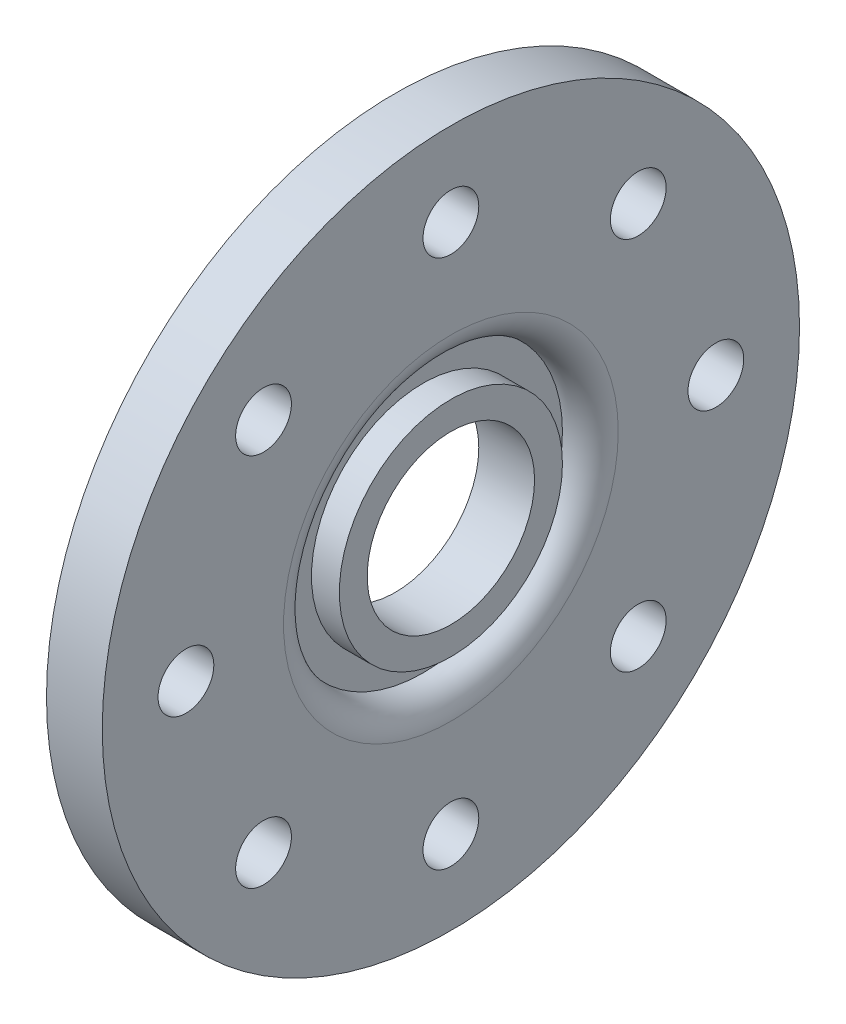
ISO-10303-21;
HEADER;
FILE_DESCRIPTION(('STEP AP214'),'2;1');
FILE_NAME('part.step','',(''),(''),'','','');
FILE_SCHEMA(('AUTOMOTIVE_DESIGN { 1 0 10303 214 1 1 1 1 }'));
ENDSEC;
DATA;
#1=APPLICATION_CONTEXT('core data for automotive mechanical design processes');
#2=APPLICATION_PROTOCOL_DEFINITION('international standard','automotive_design',2000,#1);
#3=PRODUCT_CONTEXT('',#1,'mechanical');
#4=PRODUCT('Part','Part','',(#3));
#5=PRODUCT_RELATED_PRODUCT_CATEGORY('part','',(#4));
#6=PRODUCT_DEFINITION_FORMATION('','',#4);
#7=PRODUCT_DEFINITION_CONTEXT('part definition',#1,'design');
#8=PRODUCT_DEFINITION('design','',#6,#7);
#9=PRODUCT_DEFINITION_SHAPE('','',#8);
#10=(LENGTH_UNIT() NAMED_UNIT(*) SI_UNIT(.MILLI.,.METRE.));
#11=(NAMED_UNIT(*) PLANE_ANGLE_UNIT() SI_UNIT($,.RADIAN.));
#12=(NAMED_UNIT(*) SI_UNIT($,.STERADIAN.) SOLID_ANGLE_UNIT());
#13=UNCERTAINTY_MEASURE_WITH_UNIT(LENGTH_MEASURE(1.E-05),#10,'distance_accuracy_value','');
#14=(GEOMETRIC_REPRESENTATION_CONTEXT(3) GLOBAL_UNCERTAINTY_ASSIGNED_CONTEXT((#13)) GLOBAL_UNIT_ASSIGNED_CONTEXT((#10,
#11,#12)) REPRESENTATION_CONTEXT('',''));
#15=CARTESIAN_POINT('',(0.,0.,0.));
#16=DIRECTION('',(0.,0.,1.));
#17=DIRECTION('',(1.,0.,0.));
#18=AXIS2_PLACEMENT_3D('',#15,#16,#17);
#19=CARTESIAN_POINT('',(2.,0.,0.));
#20=DIRECTION('',(1.,0.,0.));
#21=DIRECTION('',(0.,0.,-1.));
#22=AXIS2_PLACEMENT_3D('',#19,#20,#21);
#23=PLANE('',#22);
#24=CARTESIAN_POINT('',(2.,0.,0.));
#25=DIRECTION('',(1.,0.,0.));
#26=DIRECTION('',(0.,0.,-1.));
#27=AXIS2_PLACEMENT_3D('',#24,#25,#26);
#28=CIRCLE('',#27,3.);
#29=CARTESIAN_POINT('',(2.,0.,-3.));
#30=VERTEX_POINT('',#29);
#31=EDGE_CURVE('E42',#30,#30,#28,.T.);
#32=ORIENTED_EDGE('',*,*,#31,.F.);
#33=EDGE_LOOP('',(#32));
#34=FACE_BOUND('',#33,.T.);
#35=CARTESIAN_POINT('',(2.,0.,0.));
#36=DIRECTION('',(1.,0.,0.));
#37=DIRECTION('',(0.,0.,-1.));
#38=AXIS2_PLACEMENT_3D('',#35,#36,#37);
#39=CIRCLE('',#38,4.);
#40=CARTESIAN_POINT('',(2.,0.,-4.));
#41=VERTEX_POINT('',#40);
#42=EDGE_CURVE('E161',#41,#41,#39,.T.);
#43=ORIENTED_EDGE('',*,*,#42,.T.);
#44=EDGE_LOOP('',(#43));
#45=FACE_BOUND('',#44,.T.);
#46=ADVANCED_FACE('F35',(#34,#45),#23,.T.);
#47=CARTESIAN_POINT('',(2.,0.,0.));
#48=DIRECTION('',(-1.,0.,0.));
#49=DIRECTION('',(0.,0.,1.));
#50=AXIS2_PLACEMENT_3D('',#47,#48,#49);
#51=CYLINDRICAL_SURFACE('',#50,12.5);
#52=CARTESIAN_POINT('',(2.,0.,0.));
#53=DIRECTION('',(1.,0.,0.));
#54=DIRECTION('',(0.,0.,-1.));
#55=AXIS2_PLACEMENT_3D('',#52,#53,#54);
#56=CIRCLE('',#55,12.5);
#57=CARTESIAN_POINT('',(2.,0.,-12.5));
#58=VERTEX_POINT('',#57);
#59=EDGE_CURVE('E46',#58,#58,#56,.T.);
#60=ORIENTED_EDGE('',*,*,#59,.F.);
#61=EDGE_LOOP('',(#60));
#62=FACE_BOUND('',#61,.T.);
#63=CARTESIAN_POINT('',(0.,0.,0.));
#64=DIRECTION('',(1.,0.,0.));
#65=DIRECTION('',(0.,0.,-1.));
#66=AXIS2_PLACEMENT_3D('',#63,#64,#65);
#67=CIRCLE('',#66,12.5);
#68=CARTESIAN_POINT('',(0.,0.,-12.5));
#69=VERTEX_POINT('',#68);
#70=EDGE_CURVE('E80',#69,#69,#67,.T.);
#71=ORIENTED_EDGE('',*,*,#70,.T.);
#72=EDGE_LOOP('',(#71));
#73=FACE_BOUND('',#72,.T.);
#74=ADVANCED_FACE('F125',(#62,#73),#51,.T.);
#75=CARTESIAN_POINT('',(2.,-6.7175144212722,-6.7175144212722));
#76=DIRECTION('',(-1.,0.,0.));
#77=DIRECTION('',(0.,0.,1.));
#78=AXIS2_PLACEMENT_3D('',#75,#76,#77);
#79=CYLINDRICAL_SURFACE('',#78,1.);
#80=CARTESIAN_POINT('',(2.,-6.7175144212722,-6.7175144212722));
#81=DIRECTION('',(1.,0.,0.));
#82=DIRECTION('',(0.,0.,-1.));
#83=AXIS2_PLACEMENT_3D('',#80,#81,#82);
#84=CIRCLE('',#83,1.);
#85=CARTESIAN_POINT('',(2.,-6.7175144212722,-7.7175144212722));
#86=VERTEX_POINT('',#85);
#87=EDGE_CURVE('E51',#86,#86,#84,.T.);
#88=ORIENTED_EDGE('',*,*,#87,.T.);
#89=EDGE_LOOP('',(#88));
#90=FACE_BOUND('',#89,.T.);
#91=CARTESIAN_POINT('',(0.,-6.7175144212722,-6.7175144212722));
#92=DIRECTION('',(1.,0.,0.));
#93=DIRECTION('',(0.,0.,-1.));
#94=AXIS2_PLACEMENT_3D('',#91,#92,#93);
#95=CIRCLE('',#94,1.);
#96=CARTESIAN_POINT('',(0.,-6.7175144212722,-7.7175144212722));
#97=VERTEX_POINT('',#96);
#98=EDGE_CURVE('E77',#97,#97,#95,.T.);
#99=ORIENTED_EDGE('',*,*,#98,.F.);
#100=EDGE_LOOP('',(#99));
#101=FACE_BOUND('',#100,.T.);
#102=ADVANCED_FACE('F114',(#90,#101),#79,.F.);
#103=CARTESIAN_POINT('',(2.,-9.5,0.));
#104=DIRECTION('',(-1.,0.,0.));
#105=DIRECTION('',(0.,0.,1.));
#106=AXIS2_PLACEMENT_3D('',#103,#104,#105);
#107=CYLINDRICAL_SURFACE('',#106,1.);
#108=CARTESIAN_POINT('',(2.,-9.5,0.));
#109=DIRECTION('',(1.,0.,0.));
#110=DIRECTION('',(0.,0.,-1.));
#111=AXIS2_PLACEMENT_3D('',#108,#109,#110);
#112=CIRCLE('',#111,1.);
#113=CARTESIAN_POINT('',(2.,-9.5,-1.));
#114=VERTEX_POINT('',#113);
#115=EDGE_CURVE('E109',#114,#114,#112,.T.);
#116=ORIENTED_EDGE('',*,*,#115,.T.);
#117=EDGE_LOOP('',(#116));
#118=FACE_BOUND('',#117,.T.);
#119=CARTESIAN_POINT('',(0.,-9.5,0.));
#120=DIRECTION('',(1.,0.,0.));
#121=DIRECTION('',(0.,0.,-1.));
#122=AXIS2_PLACEMENT_3D('',#119,#120,#121);
#123=CIRCLE('',#122,1.);
#124=CARTESIAN_POINT('',(0.,-9.5,-1.));
#125=VERTEX_POINT('',#124);
#126=EDGE_CURVE('E74',#125,#125,#123,.T.);
#127=ORIENTED_EDGE('',*,*,#126,.F.);
#128=EDGE_LOOP('',(#127));
#129=FACE_BOUND('',#128,.T.);
#130=ADVANCED_FACE('F258',(#118,#129),#107,.F.);
#131=CARTESIAN_POINT('',(2.,-6.7175144212722,6.7175144212722));
#132=DIRECTION('',(-1.,0.,0.));
#133=DIRECTION('',(0.,0.,1.));
#134=AXIS2_PLACEMENT_3D('',#131,#132,#133);
#135=CYLINDRICAL_SURFACE('',#134,1.);
#136=CARTESIAN_POINT('',(2.,-6.7175144212722,6.7175144212722));
#137=DIRECTION('',(1.,0.,0.));
#138=DIRECTION('',(0.,0.,-1.));
#139=AXIS2_PLACEMENT_3D('',#136,#137,#138);
#140=CIRCLE('',#139,1.);
#141=CARTESIAN_POINT('',(2.,-6.7175144212722,5.7175144212722));
#142=VERTEX_POINT('',#141);
#143=EDGE_CURVE('E106',#142,#142,#140,.T.);
#144=ORIENTED_EDGE('',*,*,#143,.T.);
#145=EDGE_LOOP('',(#144));
#146=FACE_BOUND('',#145,.T.);
#147=CARTESIAN_POINT('',(0.,-6.7175144212722,6.7175144212722));
#148=DIRECTION('',(1.,0.,0.));
#149=DIRECTION('',(0.,0.,-1.));
#150=AXIS2_PLACEMENT_3D('',#147,#148,#149);
#151=CIRCLE('',#150,1.);
#152=CARTESIAN_POINT('',(0.,-6.7175144212722,5.7175144212722));
#153=VERTEX_POINT('',#152);
#154=EDGE_CURVE('E71',#153,#153,#151,.T.);
#155=ORIENTED_EDGE('',*,*,#154,.F.);
#156=EDGE_LOOP('',(#155));
#157=FACE_BOUND('',#156,.T.);
#158=ADVANCED_FACE('F248',(#146,#157),#135,.F.);
#159=CARTESIAN_POINT('',(2.,0.,9.5));
#160=DIRECTION('',(-1.,0.,0.));
#161=DIRECTION('',(0.,0.,1.));
#162=AXIS2_PLACEMENT_3D('',#159,#160,#161);
#163=CYLINDRICAL_SURFACE('',#162,1.);
#164=CARTESIAN_POINT('',(2.,0.,9.5));
#165=DIRECTION('',(1.,0.,0.));
#166=DIRECTION('',(0.,0.,-1.));
#167=AXIS2_PLACEMENT_3D('',#164,#165,#166);
#168=CIRCLE('',#167,1.);
#169=CARTESIAN_POINT('',(2.,0.,8.5));
#170=VERTEX_POINT('',#169);
#171=EDGE_CURVE('E103',#170,#170,#168,.T.);
#172=ORIENTED_EDGE('',*,*,#171,.T.);
#173=EDGE_LOOP('',(#172));
#174=FACE_BOUND('',#173,.T.);
#175=CARTESIAN_POINT('',(0.,0.,9.5));
#176=DIRECTION('',(1.,0.,0.));
#177=DIRECTION('',(0.,0.,-1.));
#178=AXIS2_PLACEMENT_3D('',#175,#176,#177);
#179=CIRCLE('',#178,1.);
#180=CARTESIAN_POINT('',(0.,0.,8.5));
#181=VERTEX_POINT('',#180);
#182=EDGE_CURVE('E68',#181,#181,#179,.T.);
#183=ORIENTED_EDGE('',*,*,#182,.F.);
#184=EDGE_LOOP('',(#183));
#185=FACE_BOUND('',#184,.T.);
#186=ADVANCED_FACE('F238',(#174,#185),#163,.F.);
#187=CARTESIAN_POINT('',(2.,6.7175144212722,6.7175144212722));
#188=DIRECTION('',(-1.,0.,0.));
#189=DIRECTION('',(0.,0.,1.));
#190=AXIS2_PLACEMENT_3D('',#187,#188,#189);
#191=CYLINDRICAL_SURFACE('',#190,1.);
#192=CARTESIAN_POINT('',(2.,6.7175144212722,6.7175144212722));
#193=DIRECTION('',(1.,0.,0.));
#194=DIRECTION('',(0.,0.,-1.));
#195=AXIS2_PLACEMENT_3D('',#192,#193,#194);
#196=CIRCLE('',#195,1.);
#197=CARTESIAN_POINT('',(2.,6.7175144212722,5.7175144212722));
#198=VERTEX_POINT('',#197);
#199=EDGE_CURVE('E100',#198,#198,#196,.T.);
#200=ORIENTED_EDGE('',*,*,#199,.T.);
#201=EDGE_LOOP('',(#200));
#202=FACE_BOUND('',#201,.T.);
#203=CARTESIAN_POINT('',(0.,6.7175144212722,6.7175144212722));
#204=DIRECTION('',(1.,0.,0.));
#205=DIRECTION('',(0.,0.,-1.));
#206=AXIS2_PLACEMENT_3D('',#203,#204,#205);
#207=CIRCLE('',#206,1.);
#208=CARTESIAN_POINT('',(0.,6.7175144212722,5.7175144212722));
#209=VERTEX_POINT('',#208);
#210=EDGE_CURVE('E65',#209,#209,#207,.T.);
#211=ORIENTED_EDGE('',*,*,#210,.F.);
#212=EDGE_LOOP('',(#211));
#213=FACE_BOUND('',#212,.T.);
#214=ADVANCED_FACE('F228',(#202,#213),#191,.F.);
#215=CARTESIAN_POINT('',(2.,9.5,0.));
#216=DIRECTION('',(-1.,0.,0.));
#217=DIRECTION('',(0.,0.,1.));
#218=AXIS2_PLACEMENT_3D('',#215,#216,#217);
#219=CYLINDRICAL_SURFACE('',#218,1.);
#220=CARTESIAN_POINT('',(2.,9.5,0.));
#221=DIRECTION('',(1.,0.,0.));
#222=DIRECTION('',(0.,0.,-1.));
#223=AXIS2_PLACEMENT_3D('',#220,#221,#222);
#224=CIRCLE('',#223,1.);
#225=CARTESIAN_POINT('',(2.,9.5,-1.));
#226=VERTEX_POINT('',#225);
#227=EDGE_CURVE('E93',#226,#226,#224,.T.);
#228=ORIENTED_EDGE('',*,*,#227,.T.);
#229=EDGE_LOOP('',(#228));
#230=FACE_BOUND('',#229,.T.);
#231=CARTESIAN_POINT('',(0.,9.5,0.));
#232=DIRECTION('',(1.,0.,0.));
#233=DIRECTION('',(0.,0.,-1.));
#234=AXIS2_PLACEMENT_3D('',#231,#232,#233);
#235=CIRCLE('',#234,1.);
#236=CARTESIAN_POINT('',(0.,9.5,-1.));
#237=VERTEX_POINT('',#236);
#238=EDGE_CURVE('E62',#237,#237,#235,.T.);
#239=ORIENTED_EDGE('',*,*,#238,.F.);
#240=EDGE_LOOP('',(#239));
#241=FACE_BOUND('',#240,.T.);
#242=ADVANCED_FACE('F218',(#230,#241),#219,.F.);
#243=CARTESIAN_POINT('',(2.,6.7175144212722,-6.7175144212722));
#244=DIRECTION('',(-1.,0.,0.));
#245=DIRECTION('',(0.,0.,1.));
#246=AXIS2_PLACEMENT_3D('',#243,#244,#245);
#247=CYLINDRICAL_SURFACE('',#246,1.);
#248=CARTESIAN_POINT('',(2.,6.7175144212722,-6.7175144212722));
#249=DIRECTION('',(1.,0.,0.));
#250=DIRECTION('',(0.,0.,-1.));
#251=AXIS2_PLACEMENT_3D('',#248,#249,#250);
#252=CIRCLE('',#251,1.);
#253=CARTESIAN_POINT('',(2.,6.7175144212722,-7.7175144212722));
#254=VERTEX_POINT('',#253);
#255=EDGE_CURVE('E88',#254,#254,#252,.T.);
#256=ORIENTED_EDGE('',*,*,#255,.T.);
#257=EDGE_LOOP('',(#256));
#258=FACE_BOUND('',#257,.T.);
#259=CARTESIAN_POINT('',(0.,6.7175144212722,-6.7175144212722));
#260=DIRECTION('',(1.,0.,0.));
#261=DIRECTION('',(0.,0.,-1.));
#262=AXIS2_PLACEMENT_3D('',#259,#260,#261);
#263=CIRCLE('',#262,1.);
#264=CARTESIAN_POINT('',(0.,6.7175144212722,-7.7175144212722));
#265=VERTEX_POINT('',#264);
#266=EDGE_CURVE('E58',#265,#265,#263,.T.);
#267=ORIENTED_EDGE('',*,*,#266,.F.);
#268=EDGE_LOOP('',(#267));
#269=FACE_BOUND('',#268,.T.);
#270=ADVANCED_FACE('F210',(#258,#269),#247,.F.);
#271=CARTESIAN_POINT('',(2.,0.,-9.5));
#272=DIRECTION('',(-1.,0.,0.));
#273=DIRECTION('',(0.,0.,1.));
#274=AXIS2_PLACEMENT_3D('',#271,#272,#273);
#275=CYLINDRICAL_SURFACE('',#274,1.);
#276=CARTESIAN_POINT('',(2.,0.,-9.5));
#277=DIRECTION('',(1.,0.,0.));
#278=DIRECTION('',(0.,0.,-1.));
#279=AXIS2_PLACEMENT_3D('',#276,#277,#278);
#280=CIRCLE('',#279,1.);
#281=CARTESIAN_POINT('',(2.,0.,-10.5));
#282=VERTEX_POINT('',#281);
#283=EDGE_CURVE('E84',#282,#282,#280,.T.);
#284=ORIENTED_EDGE('',*,*,#283,.T.);
#285=EDGE_LOOP('',(#284));
#286=FACE_BOUND('',#285,.T.);
#287=CARTESIAN_POINT('',(0.,0.,-9.5));
#288=DIRECTION('',(1.,0.,0.));
#289=DIRECTION('',(0.,0.,-1.));
#290=AXIS2_PLACEMENT_3D('',#287,#288,#289);
#291=CIRCLE('',#290,1.);
#292=CARTESIAN_POINT('',(0.,0.,-10.5));
#293=VERTEX_POINT('',#292);
#294=EDGE_CURVE('E55',#293,#293,#291,.T.);
#295=ORIENTED_EDGE('',*,*,#294,.F.);
#296=EDGE_LOOP('',(#295));
#297=FACE_BOUND('',#296,.T.);
#298=ADVANCED_FACE('F202',(#286,#297),#275,.F.);
#299=CARTESIAN_POINT('',(2.,0.,0.));
#300=DIRECTION('',(-1.,0.,0.));
#301=DIRECTION('',(0.,0.,1.));
#302=AXIS2_PLACEMENT_3D('',#299,#300,#301);
#303=CYLINDRICAL_SURFACE('',#302,3.);
#304=ORIENTED_EDGE('',*,*,#31,.T.);
#305=EDGE_LOOP('',(#304));
#306=FACE_BOUND('',#305,.T.);
#307=CARTESIAN_POINT('',(0.,0.,0.));
#308=DIRECTION('',(1.,0.,0.));
#309=DIRECTION('',(0.,0.,-1.));
#310=AXIS2_PLACEMENT_3D('',#307,#308,#309);
#311=CIRCLE('',#310,3.);
#312=CARTESIAN_POINT('',(0.,0.,-3.));
#313=VERTEX_POINT('',#312);
#314=EDGE_CURVE('E82',#313,#313,#311,.T.);
#315=ORIENTED_EDGE('',*,*,#314,.F.);
#316=EDGE_LOOP('',(#315));
#317=FACE_BOUND('',#316,.T.);
#318=ADVANCED_FACE('F121',(#306,#317),#303,.F.);
#319=CARTESIAN_POINT('',(2.,0.,0.));
#320=DIRECTION('',(1.,0.,0.));
#321=DIRECTION('',(0.,0.,-1.));
#322=AXIS2_PLACEMENT_3D('',#319,#320,#321);
#323=CIRCLE('',#322,6.);
#324=CARTESIAN_POINT('',(2.,0.,-6.));
#325=VERTEX_POINT('',#324);
#326=EDGE_CURVE('E10',#325,#325,#323,.F.);
#327=ORIENTED_EDGE('',*,*,#326,.T.);
#328=EDGE_LOOP('',(#327));
#329=FACE_BOUND('',#328,.T.);
#330=ORIENTED_EDGE('',*,*,#283,.F.);
#331=EDGE_LOOP('',(#330));
#332=FACE_BOUND('',#331,.T.);
#333=ORIENTED_EDGE('',*,*,#255,.F.);
#334=EDGE_LOOP('',(#333));
#335=FACE_BOUND('',#334,.T.);
#336=ORIENTED_EDGE('',*,*,#227,.F.);
#337=EDGE_LOOP('',(#336));
#338=FACE_BOUND('',#337,.T.);
#339=ORIENTED_EDGE('',*,*,#199,.F.);
#340=EDGE_LOOP('',(#339));
#341=FACE_BOUND('',#340,.T.);
#342=ORIENTED_EDGE('',*,*,#171,.F.);
#343=EDGE_LOOP('',(#342));
#344=FACE_BOUND('',#343,.T.);
#345=ORIENTED_EDGE('',*,*,#143,.F.);
#346=EDGE_LOOP('',(#345));
#347=FACE_BOUND('',#346,.T.);
#348=ORIENTED_EDGE('',*,*,#115,.F.);
#349=EDGE_LOOP('',(#348));
#350=FACE_BOUND('',#349,.T.);
#351=ORIENTED_EDGE('',*,*,#87,.F.);
#352=EDGE_LOOP('',(#351));
#353=FACE_BOUND('',#352,.T.);
#354=ORIENTED_EDGE('',*,*,#59,.T.);
#355=EDGE_LOOP('',(#354));
#356=FACE_BOUND('',#355,.T.);
#357=ADVANCED_FACE('F117',(#329,#332,#335,#338,#341,#344,#347,#350,#353,#356),#23,.T.);
#358=CARTESIAN_POINT('',(0.,0.,0.));
#359=DIRECTION('',(1.,0.,0.));
#360=DIRECTION('',(0.,0.,-1.));
#361=AXIS2_PLACEMENT_3D('',#358,#359,#360);
#362=PLANE('',#361);
#363=ORIENTED_EDGE('',*,*,#294,.T.);
#364=EDGE_LOOP('',(#363));
#365=FACE_BOUND('',#364,.T.);
#366=ORIENTED_EDGE('',*,*,#266,.T.);
#367=EDGE_LOOP('',(#366));
#368=FACE_BOUND('',#367,.T.);
#369=ORIENTED_EDGE('',*,*,#238,.T.);
#370=EDGE_LOOP('',(#369));
#371=FACE_BOUND('',#370,.T.);
#372=ORIENTED_EDGE('',*,*,#210,.T.);
#373=EDGE_LOOP('',(#372));
#374=FACE_BOUND('',#373,.T.);
#375=ORIENTED_EDGE('',*,*,#182,.T.);
#376=EDGE_LOOP('',(#375));
#377=FACE_BOUND('',#376,.T.);
#378=ORIENTED_EDGE('',*,*,#154,.T.);
#379=EDGE_LOOP('',(#378));
#380=FACE_BOUND('',#379,.T.);
#381=ORIENTED_EDGE('',*,*,#126,.T.);
#382=EDGE_LOOP('',(#381));
#383=FACE_BOUND('',#382,.T.);
#384=ORIENTED_EDGE('',*,*,#98,.T.);
#385=EDGE_LOOP('',(#384));
#386=FACE_BOUND('',#385,.T.);
#387=ORIENTED_EDGE('',*,*,#70,.F.);
#388=EDGE_LOOP('',(#387));
#389=FACE_BOUND('',#388,.T.);
#390=ORIENTED_EDGE('',*,*,#314,.T.);
#391=EDGE_LOOP('',(#390));
#392=FACE_BOUND('',#391,.T.);
#393=ADVANCED_FACE('F120',(#365,#368,#371,#374,#377,#380,#383,#386,#389,#392),#362,.F.);
#394=CARTESIAN_POINT('',(1.,0.,0.));
#395=DIRECTION('',(1.,0.,0.));
#396=DIRECTION('',(0.,0.,-1.));
#397=AXIS2_PLACEMENT_3D('',#394,#395,#396);
#398=PLANE('',#397);
#399=CARTESIAN_POINT('',(1.,0.,0.));
#400=DIRECTION('',(1.,0.,0.));
#401=DIRECTION('',(0.,0.,-1.));
#402=AXIS2_PLACEMENT_3D('',#399,#400,#401);
#403=CIRCLE('',#402,4.);
#404=CARTESIAN_POINT('',(1.,0.,-4.));
#405=VERTEX_POINT('',#404);
#406=EDGE_CURVE('E158',#405,#405,#403,.T.);
#407=ORIENTED_EDGE('',*,*,#406,.F.);
#408=EDGE_LOOP('',(#407));
#409=FACE_BOUND('',#408,.T.);
#410=CARTESIAN_POINT('',(1.,0.,0.));
#411=DIRECTION('',(1.,0.,0.));
#412=DIRECTION('',(0.,0.,-1.));
#413=AXIS2_PLACEMENT_3D('',#410,#411,#412);
#414=CIRCLE('',#413,5.);
#415=CARTESIAN_POINT('',(1.,0.,-5.));
#416=VERTEX_POINT('',#415);
#417=EDGE_CURVE('E59',#416,#416,#414,.T.);
#418=ORIENTED_EDGE('',*,*,#417,.T.);
#419=EDGE_LOOP('',(#418));
#420=FACE_BOUND('',#419,.T.);
#421=ADVANCED_FACE('F132',(#409,#420),#398,.T.);
#422=CARTESIAN_POINT('',(1.,0.,0.));
#423=DIRECTION('',(1.,0.,0.));
#424=DIRECTION('',(0.,0.,-1.));
#425=AXIS2_PLACEMENT_3D('',#422,#423,#424);
#426=CYLINDRICAL_SURFACE('',#425,4.);
#427=ORIENTED_EDGE('',*,*,#406,.T.);
#428=EDGE_LOOP('',(#427));
#429=FACE_BOUND('',#428,.T.);
#430=ORIENTED_EDGE('',*,*,#42,.F.);
#431=EDGE_LOOP('',(#430));
#432=FACE_BOUND('',#431,.T.);
#433=ADVANCED_FACE('F138',(#429,#432),#426,.T.);
#434=CARTESIAN_POINT('',(1.,0.,0.));
#435=DIRECTION('',(1.,0.,0.));
#436=DIRECTION('',(0.,0.,-1.));
#437=AXIS2_PLACEMENT_3D('',#434,#435,#436);
#438=TOROIDAL_SURFACE('',#437,6.,1.);
#439=ORIENTED_EDGE('',*,*,#326,.F.);
#440=EDGE_LOOP('',(#439));
#441=FACE_BOUND('',#440,.T.);
#442=ORIENTED_EDGE('',*,*,#417,.F.);
#443=EDGE_LOOP('',(#442));
#444=FACE_BOUND('',#443,.T.);
#445=ADVANCED_FACE('F37',(#441,#444),#438,.T.);
#446=CLOSED_SHELL('',(#46,#74,#102,#130,#158,#186,#214,#242,#270,#298,#318,#357,#393,#421,#433,#445));
#447=MANIFOLD_SOLID_BREP('B2',#446);
#448=ADVANCED_BREP_SHAPE_REPRESENTATION('',(#18,#447),#14);
#449=SHAPE_DEFINITION_REPRESENTATION(#9,#448);
ENDSEC;
END-ISO-10303-21;
